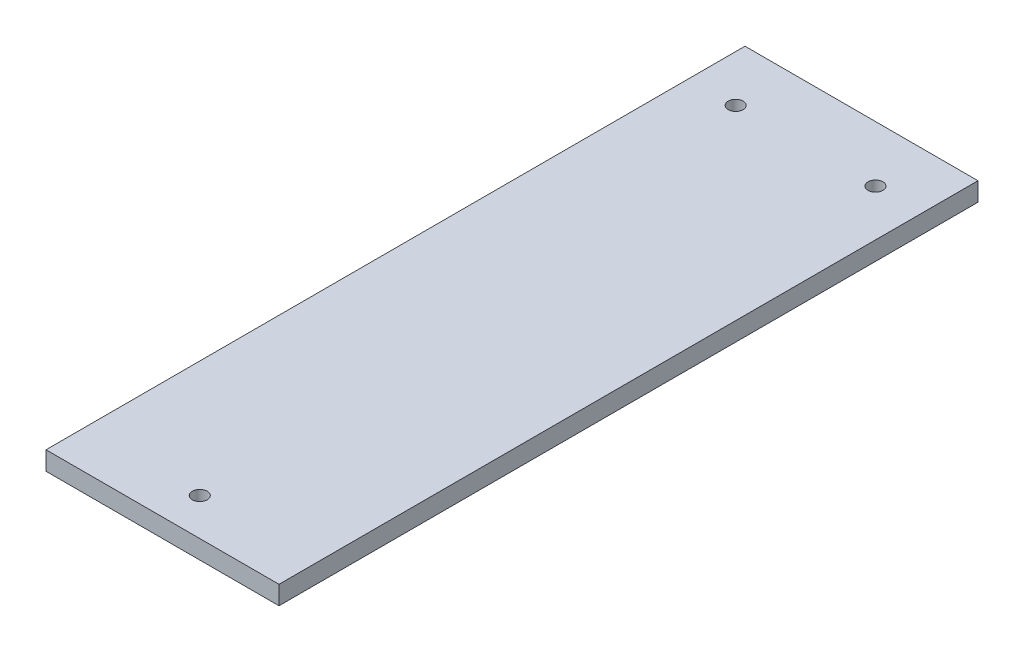
ISO-10303-21;
HEADER;
FILE_DESCRIPTION(('STEP AP214'),'2;1');
FILE_NAME('part.step','',(''),(''),'','','');
FILE_SCHEMA(('AUTOMOTIVE_DESIGN { 1 0 10303 214 1 1 1 1 }'));
ENDSEC;
DATA;
#1=APPLICATION_CONTEXT('core data for automotive mechanical design processes');
#2=APPLICATION_PROTOCOL_DEFINITION('international standard','automotive_design',2000,#1);
#3=PRODUCT_CONTEXT('',#1,'mechanical');
#4=PRODUCT('Part','Part','',(#3));
#5=PRODUCT_RELATED_PRODUCT_CATEGORY('part','',(#4));
#6=PRODUCT_DEFINITION_FORMATION('','',#4);
#7=PRODUCT_DEFINITION_CONTEXT('part definition',#1,'design');
#8=PRODUCT_DEFINITION('design','',#6,#7);
#9=PRODUCT_DEFINITION_SHAPE('','',#8);
#10=(LENGTH_UNIT() NAMED_UNIT(*) SI_UNIT(.MILLI.,.METRE.));
#11=(NAMED_UNIT(*) PLANE_ANGLE_UNIT() SI_UNIT($,.RADIAN.));
#12=(NAMED_UNIT(*) SI_UNIT($,.STERADIAN.) SOLID_ANGLE_UNIT());
#13=UNCERTAINTY_MEASURE_WITH_UNIT(LENGTH_MEASURE(1.E-05),#10,'distance_accuracy_value','');
#14=(GEOMETRIC_REPRESENTATION_CONTEXT(3) GLOBAL_UNCERTAINTY_ASSIGNED_CONTEXT((#13)) GLOBAL_UNIT_ASSIGNED_CONTEXT((#10,
#11,#12)) REPRESENTATION_CONTEXT('',''));
#15=CARTESIAN_POINT('',(0.,0.,0.));
#16=DIRECTION('',(0.,0.,1.));
#17=DIRECTION('',(1.,0.,0.));
#18=AXIS2_PLACEMENT_3D('',#15,#16,#17);
#19=CARTESIAN_POINT('',(0.,4.,0.));
#20=DIRECTION('',(0.,1.,0.));
#21=DIRECTION('',(0.,0.,1.));
#22=AXIS2_PLACEMENT_3D('',#19,#20,#21);
#23=PLANE('',#22);
#24=CARTESIAN_POINT('',(15.,4.,-63.0000000000004));
#25=DIRECTION('',(0.,1.,0.));
#26=DIRECTION('',(0.,0.,-1.));
#27=AXIS2_PLACEMENT_3D('',#24,#25,#26);
#28=CIRCLE('',#27,1.60000000000001);
#29=CARTESIAN_POINT('',(15.,4.,-64.6000000000004));
#30=VERTEX_POINT('',#29);
#31=EDGE_CURVE('E138',#30,#30,#28,.T.);
#32=ORIENTED_EDGE('',*,*,#31,.F.);
#33=EDGE_LOOP('',(#32));
#34=FACE_BOUND('',#33,.T.);
#35=DIRECTION('',(0.,0.,1.));
#36=VECTOR('',#35,1.);
#37=CARTESIAN_POINT('',(-25.,4.,74.9999999999996));
#38=LINE('',#37,#36);
#39=CARTESIAN_POINT('',(-25.,4.,-75.0000000000004));
#40=VERTEX_POINT('',#39);
#41=CARTESIAN_POINT('',(-25.,4.,74.9999999999996));
#42=VERTEX_POINT('',#41);
#43=EDGE_CURVE('E96',#40,#42,#38,.T.);
#44=ORIENTED_EDGE('',*,*,#43,.T.);
#45=DIRECTION('',(1.,0.,0.));
#46=VECTOR('',#45,1.);
#47=CARTESIAN_POINT('',(25.,4.,74.9999999999996));
#48=LINE('',#47,#46);
#49=CARTESIAN_POINT('',(25.,4.,74.9999999999996));
#50=VERTEX_POINT('',#49);
#51=EDGE_CURVE('E91',#42,#50,#48,.T.);
#52=ORIENTED_EDGE('',*,*,#51,.T.);
#53=DIRECTION('',(0.,0.,-1.));
#54=VECTOR('',#53,1.);
#55=CARTESIAN_POINT('',(25.,4.,74.9999999999996));
#56=LINE('',#55,#54);
#57=CARTESIAN_POINT('',(25.,4.,-75.0000000000004));
#58=VERTEX_POINT('',#57);
#59=EDGE_CURVE('E94',#50,#58,#56,.T.);
#60=ORIENTED_EDGE('',*,*,#59,.T.);
#61=DIRECTION('',(-1.,0.,0.));
#62=VECTOR('',#61,1.);
#63=CARTESIAN_POINT('',(25.,4.,-75.0000000000004));
#64=LINE('',#63,#62);
#65=EDGE_CURVE('E61',#58,#40,#64,.T.);
#66=ORIENTED_EDGE('',*,*,#65,.T.);
#67=EDGE_LOOP('',(#44,#52,#60,#66));
#68=FACE_BOUND('',#67,.T.);
#69=CARTESIAN_POINT('',(-15.,4.,-63.0000000000004));
#70=DIRECTION('',(0.,1.,0.));
#71=DIRECTION('',(0.,0.,1.));
#72=AXIS2_PLACEMENT_3D('',#69,#70,#71);
#73=CIRCLE('',#72,1.6);
#74=CARTESIAN_POINT('',(-15.,4.,-61.4000000000004));
#75=VERTEX_POINT('',#74);
#76=EDGE_CURVE('E116',#75,#75,#73,.T.);
#77=ORIENTED_EDGE('',*,*,#76,.F.);
#78=EDGE_LOOP('',(#77));
#79=FACE_BOUND('',#78,.T.);
#80=CARTESIAN_POINT('',(0.,4.,66.9999999999996));
#81=DIRECTION('',(0.,1.,0.));
#82=DIRECTION('',(0.,0.,1.));
#83=AXIS2_PLACEMENT_3D('',#80,#81,#82);
#84=CIRCLE('',#83,1.6);
#85=CARTESIAN_POINT('',(0.,4.,68.5999999999997));
#86=VERTEX_POINT('',#85);
#87=EDGE_CURVE('E146',#86,#86,#84,.T.);
#88=ORIENTED_EDGE('',*,*,#87,.F.);
#89=EDGE_LOOP('',(#88));
#90=FACE_BOUND('',#89,.T.);
#91=ADVANCED_FACE('F43',(#34,#68,#79,#90),#23,.T.);
#92=CARTESIAN_POINT('',(0.,0.,0.));
#93=DIRECTION('',(0.,1.,0.));
#94=DIRECTION('',(0.,0.,1.));
#95=AXIS2_PLACEMENT_3D('',#92,#93,#94);
#96=PLANE('',#95);
#97=DIRECTION('',(0.,0.,1.));
#98=VECTOR('',#97,1.);
#99=CARTESIAN_POINT('',(-25.,0.,74.9999999999996));
#100=LINE('',#99,#98);
#101=CARTESIAN_POINT('',(-25.,0.,-75.0000000000004));
#102=VERTEX_POINT('',#101);
#103=CARTESIAN_POINT('',(-25.,0.,74.9999999999996));
#104=VERTEX_POINT('',#103);
#105=EDGE_CURVE('E112',#102,#104,#100,.T.);
#106=ORIENTED_EDGE('',*,*,#105,.F.);
#107=DIRECTION('',(-1.,0.,0.));
#108=VECTOR('',#107,1.);
#109=CARTESIAN_POINT('',(25.,0.,-75.0000000000004));
#110=LINE('',#109,#108);
#111=CARTESIAN_POINT('',(25.,0.,-75.0000000000004));
#112=VERTEX_POINT('',#111);
#113=EDGE_CURVE('E84',#112,#102,#110,.T.);
#114=ORIENTED_EDGE('',*,*,#113,.F.);
#115=DIRECTION('',(0.,0.,-1.));
#116=VECTOR('',#115,1.);
#117=CARTESIAN_POINT('',(25.,0.,74.9999999999996));
#118=LINE('',#117,#116);
#119=CARTESIAN_POINT('',(25.,0.,74.9999999999996));
#120=VERTEX_POINT('',#119);
#121=EDGE_CURVE('E78',#120,#112,#118,.T.);
#122=ORIENTED_EDGE('',*,*,#121,.F.);
#123=DIRECTION('',(1.,0.,0.));
#124=VECTOR('',#123,1.);
#125=CARTESIAN_POINT('',(25.,0.,74.9999999999996));
#126=LINE('',#125,#124);
#127=EDGE_CURVE('E101',#104,#120,#126,.T.);
#128=ORIENTED_EDGE('',*,*,#127,.F.);
#129=EDGE_LOOP('',(#106,#114,#122,#128));
#130=FACE_BOUND('',#129,.T.);
#131=CARTESIAN_POINT('',(-15.,0.,-63.0000000000004));
#132=DIRECTION('',(0.,1.,0.));
#133=DIRECTION('',(0.,0.,1.));
#134=AXIS2_PLACEMENT_3D('',#131,#132,#133);
#135=CIRCLE('',#134,1.6);
#136=CARTESIAN_POINT('',(-15.,0.,-61.4000000000004));
#137=VERTEX_POINT('',#136);
#138=EDGE_CURVE('E134',#137,#137,#135,.T.);
#139=ORIENTED_EDGE('',*,*,#138,.T.);
#140=EDGE_LOOP('',(#139));
#141=FACE_BOUND('',#140,.T.);
#142=CARTESIAN_POINT('',(15.,0.,-63.0000000000004));
#143=DIRECTION('',(0.,1.,0.));
#144=DIRECTION('',(0.,0.,-1.));
#145=AXIS2_PLACEMENT_3D('',#142,#143,#144);
#146=CIRCLE('',#145,1.60000000000001);
#147=CARTESIAN_POINT('',(15.,0.,-64.6000000000004));
#148=VERTEX_POINT('',#147);
#149=EDGE_CURVE('E142',#148,#148,#146,.T.);
#150=ORIENTED_EDGE('',*,*,#149,.T.);
#151=EDGE_LOOP('',(#150));
#152=FACE_BOUND('',#151,.T.);
#153=CARTESIAN_POINT('',(0.,0.,66.9999999999996));
#154=DIRECTION('',(0.,1.,0.));
#155=DIRECTION('',(0.,0.,1.));
#156=AXIS2_PLACEMENT_3D('',#153,#154,#155);
#157=CIRCLE('',#156,1.6);
#158=CARTESIAN_POINT('',(0.,0.,68.5999999999997));
#159=VERTEX_POINT('',#158);
#160=EDGE_CURVE('E150',#159,#159,#157,.T.);
#161=ORIENTED_EDGE('',*,*,#160,.T.);
#162=EDGE_LOOP('',(#161));
#163=FACE_BOUND('',#162,.T.);
#164=ADVANCED_FACE('F129',(#130,#141,#152,#163),#96,.F.);
#165=CARTESIAN_POINT('',(-25.,4.,74.9999999999996));
#166=DIRECTION('',(1.,0.,0.));
#167=DIRECTION('',(0.,0.,-1.));
#168=AXIS2_PLACEMENT_3D('',#165,#166,#167);
#169=PLANE('',#168);
#170=ORIENTED_EDGE('',*,*,#105,.T.);
#171=DIRECTION('',(0.,-1.,0.));
#172=VECTOR('',#171,1.);
#173=CARTESIAN_POINT('',(-25.,4.,74.9999999999996));
#174=LINE('',#173,#172);
#175=EDGE_CURVE('E11',#42,#104,#174,.T.);
#176=ORIENTED_EDGE('',*,*,#175,.F.);
#177=ORIENTED_EDGE('',*,*,#43,.F.);
#178=DIRECTION('',(0.,-1.,0.));
#179=VECTOR('',#178,1.);
#180=CARTESIAN_POINT('',(-25.,4.,-75.0000000000004));
#181=LINE('',#180,#179);
#182=EDGE_CURVE('E108',#40,#102,#181,.T.);
#183=ORIENTED_EDGE('',*,*,#182,.T.);
#184=EDGE_LOOP('',(#170,#176,#177,#183));
#185=FACE_BOUND('',#184,.T.);
#186=ADVANCED_FACE('F45',(#185),#169,.F.);
#187=CARTESIAN_POINT('',(25.,4.,74.9999999999996));
#188=DIRECTION('',(0.,0.,-1.));
#189=DIRECTION('',(-1.,0.,0.));
#190=AXIS2_PLACEMENT_3D('',#187,#188,#189);
#191=PLANE('',#190);
#192=ORIENTED_EDGE('',*,*,#127,.T.);
#193=DIRECTION('',(0.,-1.,0.));
#194=VECTOR('',#193,1.);
#195=CARTESIAN_POINT('',(25.,4.,74.9999999999996));
#196=LINE('',#195,#194);
#197=EDGE_CURVE('E53',#50,#120,#196,.T.);
#198=ORIENTED_EDGE('',*,*,#197,.F.);
#199=ORIENTED_EDGE('',*,*,#51,.F.);
#200=ORIENTED_EDGE('',*,*,#175,.T.);
#201=EDGE_LOOP('',(#192,#198,#199,#200));
#202=FACE_BOUND('',#201,.T.);
#203=ADVANCED_FACE('F100',(#202),#191,.F.);
#204=CARTESIAN_POINT('',(25.,4.,74.9999999999996));
#205=DIRECTION('',(-1.,0.,0.));
#206=DIRECTION('',(0.,0.,1.));
#207=AXIS2_PLACEMENT_3D('',#204,#205,#206);
#208=PLANE('',#207);
#209=ORIENTED_EDGE('',*,*,#121,.T.);
#210=DIRECTION('',(0.,-1.,0.));
#211=VECTOR('',#210,1.);
#212=CARTESIAN_POINT('',(25.,4.,-75.0000000000004));
#213=LINE('',#212,#211);
#214=EDGE_CURVE('E103',#58,#112,#213,.T.);
#215=ORIENTED_EDGE('',*,*,#214,.F.);
#216=ORIENTED_EDGE('',*,*,#59,.F.);
#217=ORIENTED_EDGE('',*,*,#197,.T.);
#218=EDGE_LOOP('',(#209,#215,#216,#217));
#219=FACE_BOUND('',#218,.T.);
#220=ADVANCED_FACE('F104',(#219),#208,.F.);
#221=CARTESIAN_POINT('',(25.,4.,-75.0000000000004));
#222=DIRECTION('',(0.,0.,1.));
#223=DIRECTION('',(1.,0.,0.));
#224=AXIS2_PLACEMENT_3D('',#221,#222,#223);
#225=PLANE('',#224);
#226=ORIENTED_EDGE('',*,*,#113,.T.);
#227=ORIENTED_EDGE('',*,*,#182,.F.);
#228=ORIENTED_EDGE('',*,*,#65,.F.);
#229=ORIENTED_EDGE('',*,*,#214,.T.);
#230=EDGE_LOOP('',(#226,#227,#228,#229));
#231=FACE_BOUND('',#230,.T.);
#232=ADVANCED_FACE('F126',(#231),#225,.F.);
#233=CARTESIAN_POINT('',(-15.,4.,-63.0000000000004));
#234=DIRECTION('',(0.,-1.,0.));
#235=DIRECTION('',(0.,0.,-1.));
#236=AXIS2_PLACEMENT_3D('',#233,#234,#235);
#237=CYLINDRICAL_SURFACE('',#236,1.6);
#238=ORIENTED_EDGE('',*,*,#76,.T.);
#239=EDGE_LOOP('',(#238));
#240=FACE_BOUND('',#239,.T.);
#241=ORIENTED_EDGE('',*,*,#138,.F.);
#242=EDGE_LOOP('',(#241));
#243=FACE_BOUND('',#242,.T.);
#244=ADVANCED_FACE('F170',(#240,#243),#237,.F.);
#245=CARTESIAN_POINT('',(15.,4.,-63.0000000000004));
#246=DIRECTION('',(0.,-1.,0.));
#247=DIRECTION('',(0.,0.,-1.));
#248=AXIS2_PLACEMENT_3D('',#245,#246,#247);
#249=CYLINDRICAL_SURFACE('',#248,1.60000000000001);
#250=ORIENTED_EDGE('',*,*,#31,.T.);
#251=EDGE_LOOP('',(#250));
#252=FACE_BOUND('',#251,.T.);
#253=ORIENTED_EDGE('',*,*,#149,.F.);
#254=EDGE_LOOP('',(#253));
#255=FACE_BOUND('',#254,.T.);
#256=ADVANCED_FACE('F224',(#252,#255),#249,.F.);
#257=CARTESIAN_POINT('',(0.,4.,66.9999999999996));
#258=DIRECTION('',(0.,-1.,0.));
#259=DIRECTION('',(0.,0.,-1.));
#260=AXIS2_PLACEMENT_3D('',#257,#258,#259);
#261=CYLINDRICAL_SURFACE('',#260,1.6);
#262=ORIENTED_EDGE('',*,*,#87,.T.);
#263=EDGE_LOOP('',(#262));
#264=FACE_BOUND('',#263,.T.);
#265=ORIENTED_EDGE('',*,*,#160,.F.);
#266=EDGE_LOOP('',(#265));
#267=FACE_BOUND('',#266,.T.);
#268=ADVANCED_FACE('F158',(#264,#267),#261,.F.);
#269=CLOSED_SHELL('',(#91,#164,#186,#203,#220,#232,#244,#256,#268));
#270=MANIFOLD_SOLID_BREP('B2',#269);
#271=ADVANCED_BREP_SHAPE_REPRESENTATION('',(#18,#270),#14);
#272=SHAPE_DEFINITION_REPRESENTATION(#9,#271);
ENDSEC;
END-ISO-10303-21;
